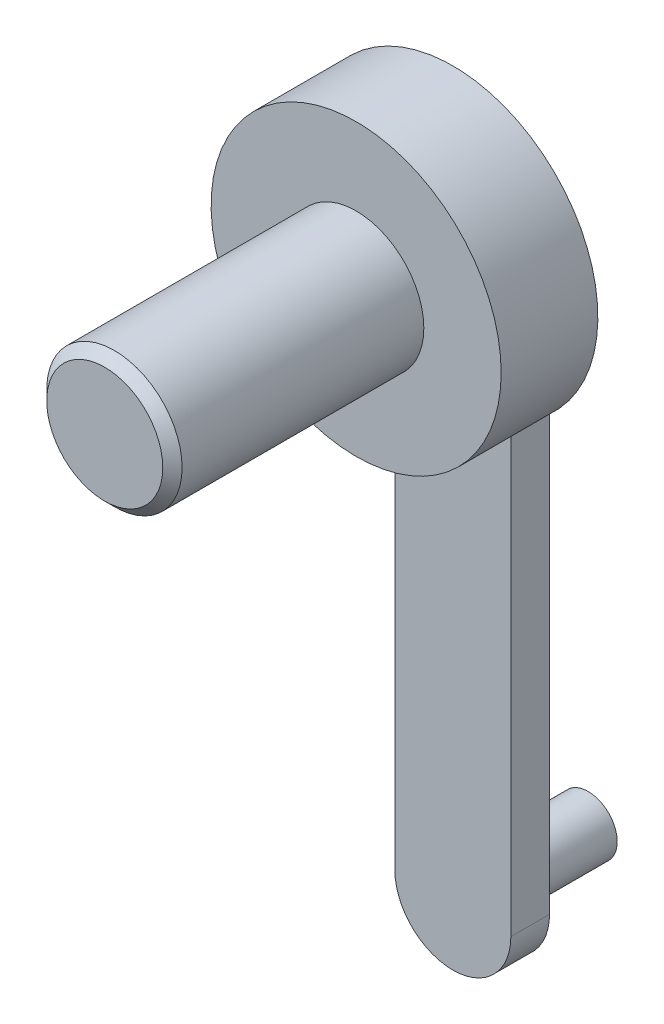
ISO-10303-21;
HEADER;
FILE_DESCRIPTION(('STEP AP214'),'2;1');
FILE_NAME('part.step','',(''),(''),'','','');
FILE_SCHEMA(('AUTOMOTIVE_DESIGN { 1 0 10303 214 1 1 1 1 }'));
ENDSEC;
DATA;
#1=APPLICATION_CONTEXT('core data for automotive mechanical design processes');
#2=APPLICATION_PROTOCOL_DEFINITION('international standard','automotive_design',2000,#1);
#3=PRODUCT_CONTEXT('',#1,'mechanical');
#4=PRODUCT('Part','Part','',(#3));
#5=PRODUCT_RELATED_PRODUCT_CATEGORY('part','',(#4));
#6=PRODUCT_DEFINITION_FORMATION('','',#4);
#7=PRODUCT_DEFINITION_CONTEXT('part definition',#1,'design');
#8=PRODUCT_DEFINITION('design','',#6,#7);
#9=PRODUCT_DEFINITION_SHAPE('','',#8);
#10=(LENGTH_UNIT() NAMED_UNIT(*) SI_UNIT(.MILLI.,.METRE.));
#11=(NAMED_UNIT(*) PLANE_ANGLE_UNIT() SI_UNIT($,.RADIAN.));
#12=(NAMED_UNIT(*) SI_UNIT($,.STERADIAN.) SOLID_ANGLE_UNIT());
#13=UNCERTAINTY_MEASURE_WITH_UNIT(LENGTH_MEASURE(1.E-05),#10,'distance_accuracy_value','');
#14=(GEOMETRIC_REPRESENTATION_CONTEXT(3) GLOBAL_UNCERTAINTY_ASSIGNED_CONTEXT((#13)) GLOBAL_UNIT_ASSIGNED_CONTEXT((#10,
#11,#12)) REPRESENTATION_CONTEXT('',''));
#15=CARTESIAN_POINT('',(0.,0.,0.));
#16=DIRECTION('',(0.,0.,1.));
#17=DIRECTION('',(1.,0.,0.));
#18=AXIS2_PLACEMENT_3D('',#15,#16,#17);
#19=CARTESIAN_POINT('',(0.,0.,0.));
#20=DIRECTION('',(0.,0.,1.));
#21=DIRECTION('',(1.,0.,0.));
#22=AXIS2_PLACEMENT_3D('',#19,#20,#21);
#23=PLANE('',#22);
#24=DIRECTION('',(0.,1.,0.));
#25=VECTOR('',#24,1.);
#26=CARTESIAN_POINT('',(-3.,0.,0.));
#27=LINE('',#26,#25);
#28=CARTESIAN_POINT('',(-3.,-6.87386354243376,0.));
#29=VERTEX_POINT('',#28);
#30=CARTESIAN_POINT('',(-3.,0.,0.));
#31=VERTEX_POINT('',#30);
#32=EDGE_CURVE('E11',#29,#31,#27,.T.);
#33=ORIENTED_EDGE('',*,*,#32,.F.);
#34=CARTESIAN_POINT('',(0.,0.,0.));
#35=DIRECTION('',(0.,0.,1.));
#36=DIRECTION('',(1.,0.,0.));
#37=AXIS2_PLACEMENT_3D('',#34,#35,#36);
#38=CIRCLE('',#37,7.5);
#39=CARTESIAN_POINT('',(3.,-6.87386354243376,0.));
#40=VERTEX_POINT('',#39);
#41=EDGE_CURVE('E105',#40,#29,#38,.T.);
#42=ORIENTED_EDGE('',*,*,#41,.F.);
#43=DIRECTION('',(0.,-1.,0.));
#44=VECTOR('',#43,1.);
#45=CARTESIAN_POINT('',(3.,0.,0.));
#46=LINE('',#45,#44);
#47=CARTESIAN_POINT('',(3.,0.,0.));
#48=VERTEX_POINT('',#47);
#49=EDGE_CURVE('E55',#48,#40,#46,.T.);
#50=ORIENTED_EDGE('',*,*,#49,.F.);
#51=CARTESIAN_POINT('',(0.,0.,0.));
#52=DIRECTION('',(0.,0.,-1.));
#53=DIRECTION('',(-1.,0.,0.));
#54=AXIS2_PLACEMENT_3D('',#51,#52,#53);
#55=CIRCLE('',#54,3.);
#56=EDGE_CURVE('E51',#31,#48,#55,.T.);
#57=ORIENTED_EDGE('',*,*,#56,.F.);
#58=EDGE_LOOP('',(#33,#42,#50,#57));
#59=FACE_BOUND('',#58,.T.);
#60=ADVANCED_FACE('F34',(#59),#23,.F.);
#61=CARTESIAN_POINT('',(0.,0.,5.));
#62=DIRECTION('',(0.,0.,-1.));
#63=DIRECTION('',(-1.,0.,0.));
#64=AXIS2_PLACEMENT_3D('',#61,#62,#63);
#65=CYLINDRICAL_SURFACE('',#64,7.5);
#66=CARTESIAN_POINT('',(0.,0.,5.));
#67=DIRECTION('',(0.,0.,1.));
#68=DIRECTION('',(1.,0.,0.));
#69=AXIS2_PLACEMENT_3D('',#66,#67,#68);
#70=CIRCLE('',#69,7.5);
#71=CARTESIAN_POINT('',(7.5,0.,5.));
#72=VERTEX_POINT('',#71);
#73=EDGE_CURVE('E111',#72,#72,#70,.T.);
#74=ORIENTED_EDGE('',*,*,#73,.F.);
#75=EDGE_LOOP('',(#74));
#76=FACE_BOUND('',#75,.T.);
#77=EDGE_CURVE('E115',#29,#40,#38,.T.);
#78=ORIENTED_EDGE('',*,*,#77,.T.);
#79=ORIENTED_EDGE('',*,*,#41,.T.);
#80=EDGE_LOOP('',(#78,#79));
#81=FACE_BOUND('',#80,.T.);
#82=ADVANCED_FACE('F135',(#76,#81),#65,.T.);
#83=CARTESIAN_POINT('',(0.,0.,5.));
#84=DIRECTION('',(0.,0.,1.));
#85=DIRECTION('',(1.,0.,0.));
#86=AXIS2_PLACEMENT_3D('',#83,#84,#85);
#87=PLANE('',#86);
#88=CARTESIAN_POINT('',(0.,0.,5.));
#89=DIRECTION('',(0.,0.,1.));
#90=DIRECTION('',(1.,0.,0.));
#91=AXIS2_PLACEMENT_3D('',#88,#89,#90);
#92=CIRCLE('',#91,3.5);
#93=CARTESIAN_POINT('',(3.5,0.,5.));
#94=VERTEX_POINT('',#93);
#95=EDGE_CURVE('E102',#94,#94,#92,.T.);
#96=ORIENTED_EDGE('',*,*,#95,.F.);
#97=EDGE_LOOP('',(#96));
#98=FACE_BOUND('',#97,.T.);
#99=ORIENTED_EDGE('',*,*,#73,.T.);
#100=EDGE_LOOP('',(#99));
#101=FACE_BOUND('',#100,.T.);
#102=ADVANCED_FACE('F140',(#98,#101),#87,.T.);
#103=CARTESIAN_POINT('',(0.,0.,18.));
#104=DIRECTION('',(0.,0.,-1.));
#105=DIRECTION('',(-1.,0.,0.));
#106=AXIS2_PLACEMENT_3D('',#103,#104,#105);
#107=CYLINDRICAL_SURFACE('',#106,3.5);
#108=CARTESIAN_POINT('',(0.,0.,17.5));
#109=DIRECTION('',(0.,0.,1.));
#110=DIRECTION('',(1.,0.,0.));
#111=AXIS2_PLACEMENT_3D('',#108,#109,#110);
#112=CIRCLE('',#111,3.5);
#113=CARTESIAN_POINT('',(3.5,0.,17.5));
#114=VERTEX_POINT('',#113);
#115=EDGE_CURVE('E38',#114,#114,#112,.F.);
#116=ORIENTED_EDGE('',*,*,#115,.T.);
#117=EDGE_LOOP('',(#116));
#118=FACE_BOUND('',#117,.T.);
#119=ORIENTED_EDGE('',*,*,#95,.T.);
#120=EDGE_LOOP('',(#119));
#121=FACE_BOUND('',#120,.T.);
#122=ADVANCED_FACE('F122',(#118,#121),#107,.T.);
#123=CARTESIAN_POINT('',(0.,0.,18.));
#124=DIRECTION('',(0.,0.,1.));
#125=DIRECTION('',(1.,0.,0.));
#126=AXIS2_PLACEMENT_3D('',#123,#124,#125);
#127=PLANE('',#126);
#128=CARTESIAN_POINT('',(0.,0.,18.));
#129=DIRECTION('',(0.,0.,1.));
#130=DIRECTION('',(1.,0.,0.));
#131=AXIS2_PLACEMENT_3D('',#128,#129,#130);
#132=CIRCLE('',#131,3.00000000000002);
#133=CARTESIAN_POINT('',(3.00000000000002,0.,18.));
#134=VERTEX_POINT('',#133);
#135=EDGE_CURVE('E114',#134,#134,#132,.T.);
#136=ORIENTED_EDGE('',*,*,#135,.T.);
#137=EDGE_LOOP('',(#136));
#138=FACE_BOUND('',#137,.T.);
#139=ADVANCED_FACE('F127',(#138),#127,.T.);
#140=CARTESIAN_POINT('',(0.,0.,18.));
#141=DIRECTION('',(0.,0.,-1.));
#142=DIRECTION('',(-1.,0.,0.));
#143=AXIS2_PLACEMENT_3D('',#140,#141,#142);
#144=CONICAL_SURFACE('',#143,3.00000000000002,0.785398163397446);
#145=ORIENTED_EDGE('',*,*,#115,.F.);
#146=EDGE_LOOP('',(#145));
#147=FACE_BOUND('',#146,.T.);
#148=ORIENTED_EDGE('',*,*,#135,.F.);
#149=EDGE_LOOP('',(#148));
#150=FACE_BOUND('',#149,.T.);
#151=ADVANCED_FACE('F36',(#147,#150),#144,.T.);
#152=CARTESIAN_POINT('',(0.,0.,-2.));
#153=DIRECTION('',(0.,0.,1.));
#154=DIRECTION('',(1.,0.,0.));
#155=AXIS2_PLACEMENT_3D('',#152,#153,#154);
#156=CYLINDRICAL_SURFACE('',#155,3.);
#157=ORIENTED_EDGE('',*,*,#56,.T.);
#158=DIRECTION('',(0.,0.,1.));
#159=VECTOR('',#158,1.);
#160=CARTESIAN_POINT('',(3.,0.,-2.));
#161=LINE('',#160,#159);
#162=CARTESIAN_POINT('',(3.,0.,-2.));
#163=VERTEX_POINT('',#162);
#164=EDGE_CURVE('E85',#163,#48,#161,.T.);
#165=ORIENTED_EDGE('',*,*,#164,.F.);
#166=CARTESIAN_POINT('',(0.,0.,-2.));
#167=DIRECTION('',(0.,0.,-1.));
#168=DIRECTION('',(-1.,0.,0.));
#169=AXIS2_PLACEMENT_3D('',#166,#167,#168);
#170=CIRCLE('',#169,3.);
#171=CARTESIAN_POINT('',(-3.,0.,-2.));
#172=VERTEX_POINT('',#171);
#173=EDGE_CURVE('E91',#172,#163,#170,.T.);
#174=ORIENTED_EDGE('',*,*,#173,.F.);
#175=DIRECTION('',(0.,0.,1.));
#176=VECTOR('',#175,1.);
#177=CARTESIAN_POINT('',(-3.,0.,-2.));
#178=LINE('',#177,#176);
#179=EDGE_CURVE('E185',#172,#31,#178,.T.);
#180=ORIENTED_EDGE('',*,*,#179,.T.);
#181=EDGE_LOOP('',(#157,#165,#174,#180));
#182=FACE_BOUND('',#181,.T.);
#183=ADVANCED_FACE('F101',(#182),#156,.T.);
#184=CARTESIAN_POINT('',(3.,0.,-2.));
#185=DIRECTION('',(-1.,0.,0.));
#186=DIRECTION('',(0.,-1.,0.));
#187=AXIS2_PLACEMENT_3D('',#184,#185,#186);
#188=PLANE('',#187);
#189=ORIENTED_EDGE('',*,*,#49,.T.);
#190=CARTESIAN_POINT('',(3.,-30.,0.));
#191=VERTEX_POINT('',#190);
#192=EDGE_CURVE('E179',#40,#191,#46,.T.);
#193=ORIENTED_EDGE('',*,*,#192,.T.);
#194=DIRECTION('',(0.,0.,1.));
#195=VECTOR('',#194,1.);
#196=CARTESIAN_POINT('',(3.,-30.,-2.));
#197=LINE('',#196,#195);
#198=CARTESIAN_POINT('',(3.,-30.,-2.));
#199=VERTEX_POINT('',#198);
#200=EDGE_CURVE('E87',#199,#191,#197,.T.);
#201=ORIENTED_EDGE('',*,*,#200,.F.);
#202=DIRECTION('',(0.,-1.,0.));
#203=VECTOR('',#202,1.);
#204=CARTESIAN_POINT('',(3.,0.,-2.));
#205=LINE('',#204,#203);
#206=EDGE_CURVE('E81',#163,#199,#205,.T.);
#207=ORIENTED_EDGE('',*,*,#206,.F.);
#208=ORIENTED_EDGE('',*,*,#164,.T.);
#209=EDGE_LOOP('',(#189,#193,#201,#207,#208));
#210=FACE_BOUND('',#209,.T.);
#211=ADVANCED_FACE('F83',(#210),#188,.F.);
#212=CARTESIAN_POINT('',(0.,-30.,-2.));
#213=DIRECTION('',(0.,0.,1.));
#214=DIRECTION('',(1.,0.,0.));
#215=AXIS2_PLACEMENT_3D('',#212,#213,#214);
#216=CYLINDRICAL_SURFACE('',#215,3.);
#217=CARTESIAN_POINT('',(0.,-30.,0.));
#218=DIRECTION('',(0.,0.,-1.));
#219=DIRECTION('',(-1.,0.,0.));
#220=AXIS2_PLACEMENT_3D('',#217,#218,#219);
#221=CIRCLE('',#220,3.);
#222=CARTESIAN_POINT('',(-3.,-30.,0.));
#223=VERTEX_POINT('',#222);
#224=EDGE_CURVE('E188',#191,#223,#221,.T.);
#225=ORIENTED_EDGE('',*,*,#224,.T.);
#226=DIRECTION('',(0.,0.,1.));
#227=VECTOR('',#226,1.);
#228=CARTESIAN_POINT('',(-3.,-30.,-2.));
#229=LINE('',#228,#227);
#230=CARTESIAN_POINT('',(-3.,-30.,-2.));
#231=VERTEX_POINT('',#230);
#232=EDGE_CURVE('E107',#231,#223,#229,.T.);
#233=ORIENTED_EDGE('',*,*,#232,.F.);
#234=CARTESIAN_POINT('',(0.,-30.,-2.));
#235=DIRECTION('',(0.,0.,-1.));
#236=DIRECTION('',(-1.,0.,0.));
#237=AXIS2_PLACEMENT_3D('',#234,#235,#236);
#238=CIRCLE('',#237,3.);
#239=EDGE_CURVE('E90',#199,#231,#238,.T.);
#240=ORIENTED_EDGE('',*,*,#239,.F.);
#241=ORIENTED_EDGE('',*,*,#200,.T.);
#242=EDGE_LOOP('',(#225,#233,#240,#241));
#243=FACE_BOUND('',#242,.T.);
#244=ADVANCED_FACE('F150',(#243),#216,.T.);
#245=CARTESIAN_POINT('',(-3.,0.,-2.));
#246=DIRECTION('',(1.,0.,0.));
#247=DIRECTION('',(0.,1.,0.));
#248=AXIS2_PLACEMENT_3D('',#245,#246,#247);
#249=PLANE('',#248);
#250=EDGE_CURVE('E44',#223,#29,#27,.T.);
#251=ORIENTED_EDGE('',*,*,#250,.T.);
#252=ORIENTED_EDGE('',*,*,#32,.T.);
#253=ORIENTED_EDGE('',*,*,#179,.F.);
#254=DIRECTION('',(0.,1.,0.));
#255=VECTOR('',#254,1.);
#256=CARTESIAN_POINT('',(-3.,0.,-2.));
#257=LINE('',#256,#255);
#258=EDGE_CURVE('E96',#231,#172,#257,.T.);
#259=ORIENTED_EDGE('',*,*,#258,.F.);
#260=ORIENTED_EDGE('',*,*,#232,.T.);
#261=EDGE_LOOP('',(#251,#252,#253,#259,#260));
#262=FACE_BOUND('',#261,.T.);
#263=ADVANCED_FACE('F153',(#262),#249,.F.);
#264=CARTESIAN_POINT('',(0.,0.,-2.));
#265=DIRECTION('',(0.,0.,-1.));
#266=DIRECTION('',(-1.,0.,0.));
#267=AXIS2_PLACEMENT_3D('',#264,#265,#266);
#268=PLANE('',#267);
#269=CARTESIAN_POINT('',(0.,-30.,-2.));
#270=DIRECTION('',(0.,0.,-1.));
#271=DIRECTION('',(-1.,0.,0.));
#272=AXIS2_PLACEMENT_3D('',#269,#270,#271);
#273=CIRCLE('',#272,1.5);
#274=CARTESIAN_POINT('',(-1.50000000000001,-30.,-2.));
#275=VERTEX_POINT('',#274);
#276=EDGE_CURVE('E177',#275,#275,#273,.T.);
#277=ORIENTED_EDGE('',*,*,#276,.F.);
#278=EDGE_LOOP('',(#277));
#279=FACE_BOUND('',#278,.T.);
#280=ORIENTED_EDGE('',*,*,#173,.T.);
#281=ORIENTED_EDGE('',*,*,#206,.T.);
#282=ORIENTED_EDGE('',*,*,#239,.T.);
#283=ORIENTED_EDGE('',*,*,#258,.T.);
#284=EDGE_LOOP('',(#280,#281,#282,#283));
#285=FACE_BOUND('',#284,.T.);
#286=ADVANCED_FACE('F94',(#279,#285),#268,.T.);
#287=CARTESIAN_POINT('',(0.,0.,0.));
#288=DIRECTION('',(0.,0.,-1.));
#289=DIRECTION('',(-1.,0.,0.));
#290=AXIS2_PLACEMENT_3D('',#287,#288,#289);
#291=PLANE('',#290);
#292=ORIENTED_EDGE('',*,*,#77,.F.);
#293=ORIENTED_EDGE('',*,*,#250,.F.);
#294=ORIENTED_EDGE('',*,*,#224,.F.);
#295=ORIENTED_EDGE('',*,*,#192,.F.);
#296=EDGE_LOOP('',(#292,#293,#294,#295));
#297=FACE_BOUND('',#296,.T.);
#298=ADVANCED_FACE('F158',(#297),#291,.F.);
#299=CARTESIAN_POINT('',(0.,-30.,-7.));
#300=DIRECTION('',(0.,0.,1.));
#301=DIRECTION('',(1.,0.,0.));
#302=AXIS2_PLACEMENT_3D('',#299,#300,#301);
#303=CYLINDRICAL_SURFACE('',#302,1.5);
#304=CARTESIAN_POINT('',(0.,-30.,-7.));
#305=DIRECTION('',(0.,0.,-1.));
#306=DIRECTION('',(-1.,0.,0.));
#307=AXIS2_PLACEMENT_3D('',#304,#305,#306);
#308=CIRCLE('',#307,1.5);
#309=CARTESIAN_POINT('',(-1.50000000000001,-30.,-7.));
#310=VERTEX_POINT('',#309);
#311=EDGE_CURVE('E176',#310,#310,#308,.T.);
#312=ORIENTED_EDGE('',*,*,#311,.F.);
#313=EDGE_LOOP('',(#312));
#314=FACE_BOUND('',#313,.T.);
#315=ORIENTED_EDGE('',*,*,#276,.T.);
#316=EDGE_LOOP('',(#315));
#317=FACE_BOUND('',#316,.T.);
#318=ADVANCED_FACE('F161',(#314,#317),#303,.T.);
#319=CARTESIAN_POINT('',(0.,-30.,-7.));
#320=DIRECTION('',(0.,0.,-1.));
#321=DIRECTION('',(-1.,0.,0.));
#322=AXIS2_PLACEMENT_3D('',#319,#320,#321);
#323=PLANE('',#322);
#324=ORIENTED_EDGE('',*,*,#311,.T.);
#325=EDGE_LOOP('',(#324));
#326=FACE_BOUND('',#325,.T.);
#327=ADVANCED_FACE('F168',(#326),#323,.T.);
#328=CLOSED_SHELL('',(#60,#82,#102,#122,#139,#151,#183,#211,#244,#263,#286,#298,#318,#327));
#329=MANIFOLD_SOLID_BREP('B2',#328);
#330=ADVANCED_BREP_SHAPE_REPRESENTATION('',(#18,#329),#14);
#331=SHAPE_DEFINITION_REPRESENTATION(#9,#330);
ENDSEC;
END-ISO-10303-21;
